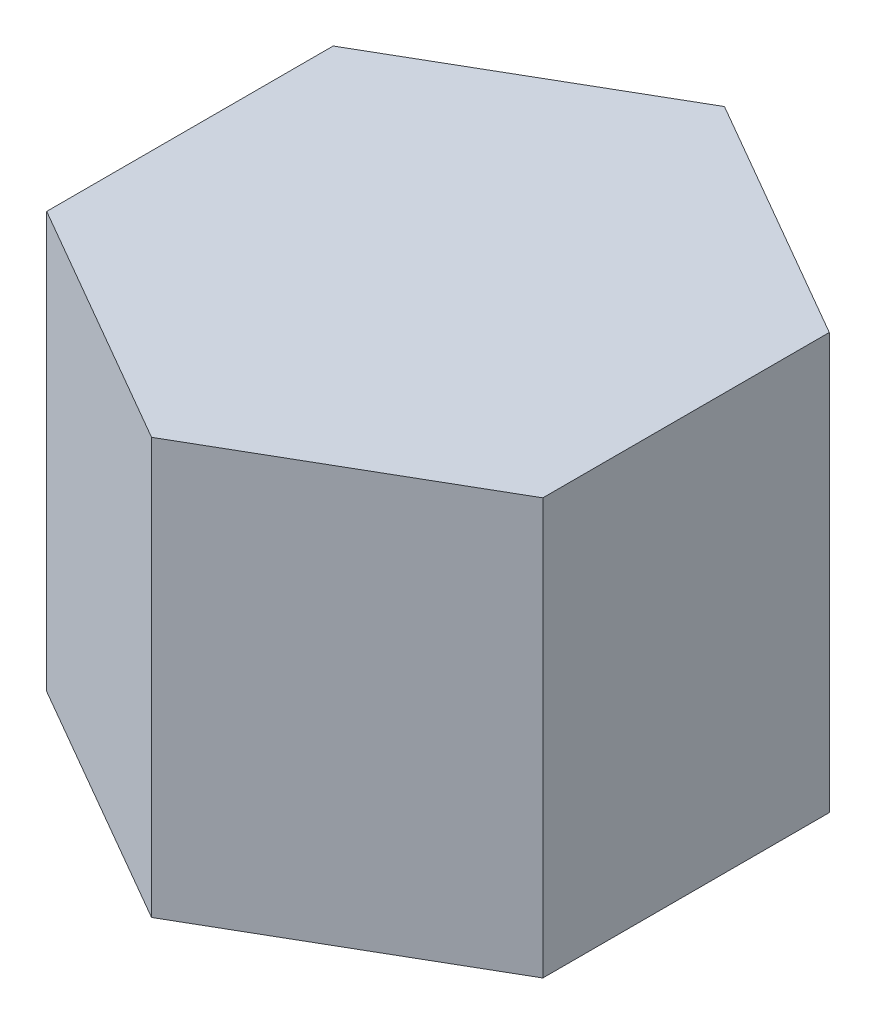
ISO-10303-21;
HEADER;
FILE_DESCRIPTION(('STEP AP214'),'2;1');
FILE_NAME('part.step','',(''),(''),'','','');
FILE_SCHEMA(('AUTOMOTIVE_DESIGN { 1 0 10303 214 1 1 1 1 }'));
ENDSEC;
DATA;
#1=APPLICATION_CONTEXT('core data for automotive mechanical design processes');
#2=APPLICATION_PROTOCOL_DEFINITION('international standard','automotive_design',2000,#1);
#3=PRODUCT_CONTEXT('',#1,'mechanical');
#4=PRODUCT('Part','Part','',(#3));
#5=PRODUCT_RELATED_PRODUCT_CATEGORY('part','',(#4));
#6=PRODUCT_DEFINITION_FORMATION('','',#4);
#7=PRODUCT_DEFINITION_CONTEXT('part definition',#1,'design');
#8=PRODUCT_DEFINITION('design','',#6,#7);
#9=PRODUCT_DEFINITION_SHAPE('','',#8);
#10=(LENGTH_UNIT() NAMED_UNIT(*) SI_UNIT(.MILLI.,.METRE.));
#11=(NAMED_UNIT(*) PLANE_ANGLE_UNIT() SI_UNIT($,.RADIAN.));
#12=(NAMED_UNIT(*) SI_UNIT($,.STERADIAN.) SOLID_ANGLE_UNIT());
#13=UNCERTAINTY_MEASURE_WITH_UNIT(LENGTH_MEASURE(1.E-05),#10,'distance_accuracy_value','');
#14=(GEOMETRIC_REPRESENTATION_CONTEXT(3) GLOBAL_UNCERTAINTY_ASSIGNED_CONTEXT((#13)) GLOBAL_UNIT_ASSIGNED_CONTEXT((#10,
#11,#12)) REPRESENTATION_CONTEXT('',''));
#15=CARTESIAN_POINT('',(0.,0.,0.));
#16=DIRECTION('',(0.,0.,1.));
#17=DIRECTION('',(1.,0.,0.));
#18=AXIS2_PLACEMENT_3D('',#15,#16,#17);
#19=CARTESIAN_POINT('',(207.642660308706,-148.537700895744,294.971072835632));
#20=DIRECTION('',(-0.499999999999909,0.,-0.866025403784491));
#21=DIRECTION('',(-0.866025403784491,0.,0.499999999999909));
#22=AXIS2_PLACEMENT_3D('',#19,#20,#21);
#23=PLANE('',#22);
#24=CARTESIAN_POINT('',(207.339551417381,-149.045793579175,295.146072835632));
#25=DIRECTION('',(0.866025403784491,0.,-0.499999999999909));
#26=VECTOR('',#25,1.);
#27=LINE('',#24,#26);
#28=CARTESIAN_POINT('',(207.339551417382,-149.045793579175,295.146072835632));
#29=VERTEX_POINT('',#28);
#30=CARTESIAN_POINT('',(207.642660308706,-149.045793579175,294.971072835632));
#31=VERTEX_POINT('',#30);
#32=EDGE_CURVE('E170',#29,#31,#27,.T.);
#33=ORIENTED_EDGE('',*,*,#32,.T.);
#34=CARTESIAN_POINT('',(207.642660308706,-148.537700895744,294.971072835632));
#35=DIRECTION('',(0.,-1.,0.));
#36=VECTOR('',#35,1.);
#37=LINE('',#34,#36);
#38=CARTESIAN_POINT('',(207.642660308706,-148.537700895744,294.971072835632));
#39=VERTEX_POINT('',#38);
#40=EDGE_CURVE('E35',#39,#31,#37,.T.);
#41=ORIENTED_EDGE('',*,*,#40,.F.);
#42=CARTESIAN_POINT('',(207.339551417381,-148.537700895744,295.146072835632));
#43=DIRECTION('',(0.866025403784491,0.,-0.499999999999909));
#44=VECTOR('',#43,1.);
#45=LINE('',#42,#44);
#46=CARTESIAN_POINT('',(207.339551417382,-148.537700895744,295.146072835632));
#47=VERTEX_POINT('',#46);
#48=EDGE_CURVE('E159',#47,#39,#45,.T.);
#49=ORIENTED_EDGE('',*,*,#48,.F.);
#50=CARTESIAN_POINT('',(207.339551417381,-148.537700895744,295.146072835632));
#51=DIRECTION('',(0.,-1.,0.));
#52=VECTOR('',#51,1.);
#53=LINE('',#50,#52);
#54=EDGE_CURVE('E10',#47,#29,#53,.T.);
#55=ORIENTED_EDGE('',*,*,#54,.T.);
#56=EDGE_LOOP('',(#33,#41,#49,#55));
#57=FACE_BOUND('',#56,.T.);
#58=ADVANCED_FACE('F16',(#57),#23,.F.);
#59=CARTESIAN_POINT('',(207.339551417382,-148.537700895744,295.146072835632));
#60=DIRECTION('',(0.500000000000062,0.,-0.866025403784403));
#61=DIRECTION('',(-0.866025403784403,0.,-0.500000000000062));
#62=AXIS2_PLACEMENT_3D('',#59,#60,#61);
#63=PLANE('',#62);
#64=CARTESIAN_POINT('',(207.036442526057,-149.045793579175,294.971072835632));
#65=DIRECTION('',(0.866025403784403,0.,0.500000000000062));
#66=VECTOR('',#65,1.);
#67=LINE('',#64,#66);
#68=CARTESIAN_POINT('',(207.036442526057,-149.045793579175,294.971072835632));
#69=VERTEX_POINT('',#68);
#70=EDGE_CURVE('E167',#69,#29,#67,.T.);
#71=ORIENTED_EDGE('',*,*,#70,.T.);
#72=ORIENTED_EDGE('',*,*,#54,.F.);
#73=CARTESIAN_POINT('',(207.036442526057,-148.537700895744,294.971072835632));
#74=DIRECTION('',(0.866025403784403,0.,0.500000000000062));
#75=VECTOR('',#74,1.);
#76=LINE('',#73,#75);
#77=CARTESIAN_POINT('',(207.036442526057,-148.537700895744,294.971072835632));
#78=VERTEX_POINT('',#77);
#79=EDGE_CURVE('E156',#78,#47,#76,.T.);
#80=ORIENTED_EDGE('',*,*,#79,.F.);
#81=CARTESIAN_POINT('',(207.036442526057,-148.537700895744,294.971072835632));
#82=DIRECTION('',(0.,-1.,0.));
#83=VECTOR('',#82,1.);
#84=LINE('',#81,#83);
#85=EDGE_CURVE('E27',#78,#69,#84,.T.);
#86=ORIENTED_EDGE('',*,*,#85,.T.);
#87=EDGE_LOOP('',(#71,#72,#80,#86));
#88=FACE_BOUND('',#87,.T.);
#89=ADVANCED_FACE('F189',(#88),#63,.F.);
#90=CARTESIAN_POINT('',(207.036442526057,-148.537700895744,290.831971220494));
#91=DIRECTION('',(1.,0.,0.));
#92=DIRECTION('',(0.,1.,0.));
#93=AXIS2_PLACEMENT_3D('',#90,#91,#92);
#94=PLANE('',#93);
#95=CARTESIAN_POINT('',(207.036442526057,-149.045793579175,294.621072835632));
#96=DIRECTION('',(0.,0.,1.));
#97=VECTOR('',#96,1.);
#98=LINE('',#95,#97);
#99=CARTESIAN_POINT('',(207.036442526057,-149.045793579175,294.621072835632));
#100=VERTEX_POINT('',#99);
#101=EDGE_CURVE('E163',#100,#69,#98,.T.);
#102=ORIENTED_EDGE('',*,*,#101,.T.);
#103=ORIENTED_EDGE('',*,*,#85,.F.);
#104=CARTESIAN_POINT('',(207.036442526057,-148.537700895744,294.621072835632));
#105=DIRECTION('',(0.,0.,1.));
#106=VECTOR('',#105,1.);
#107=LINE('',#104,#106);
#108=CARTESIAN_POINT('',(207.036442526057,-148.537700895744,294.621072835632));
#109=VERTEX_POINT('',#108);
#110=EDGE_CURVE('E106',#109,#78,#107,.T.);
#111=ORIENTED_EDGE('',*,*,#110,.F.);
#112=CARTESIAN_POINT('',(207.036442526057,-148.537700895744,294.621072835632));
#113=DIRECTION('',(0.,-1.,0.));
#114=VECTOR('',#113,1.);
#115=LINE('',#112,#114);
#116=EDGE_CURVE('E94',#109,#100,#115,.T.);
#117=ORIENTED_EDGE('',*,*,#116,.T.);
#118=EDGE_LOOP('',(#102,#103,#111,#117));
#119=FACE_BOUND('',#118,.T.);
#120=ADVANCED_FACE('F198',(#119),#94,.F.);
#121=CARTESIAN_POINT('',(207.036442526057,-148.537700895744,294.621072835632));
#122=DIRECTION('',(0.499999999999978,0.,0.866025403784452));
#123=DIRECTION('',(0.866025403784452,0.,-0.499999999999978));
#124=AXIS2_PLACEMENT_3D('',#121,#122,#123);
#125=PLANE('',#124);
#126=CARTESIAN_POINT('',(207.339551417382,-149.045793579175,294.446072835632));
#127=DIRECTION('',(-0.866025403784452,0.,0.499999999999978));
#128=VECTOR('',#127,1.);
#129=LINE('',#126,#128);
#130=CARTESIAN_POINT('',(207.339551417382,-149.045793579175,294.446072835632));
#131=VERTEX_POINT('',#130);
#132=EDGE_CURVE('E162',#131,#100,#129,.T.);
#133=ORIENTED_EDGE('',*,*,#132,.T.);
#134=ORIENTED_EDGE('',*,*,#116,.F.);
#135=CARTESIAN_POINT('',(207.339551417382,-148.537700895744,294.446072835632));
#136=DIRECTION('',(-0.866025403784452,0.,0.499999999999978));
#137=VECTOR('',#136,1.);
#138=LINE('',#135,#137);
#139=CARTESIAN_POINT('',(207.339551417382,-148.537700895744,294.446072835632));
#140=VERTEX_POINT('',#139);
#141=EDGE_CURVE('E98',#140,#109,#138,.T.);
#142=ORIENTED_EDGE('',*,*,#141,.F.);
#143=CARTESIAN_POINT('',(207.339551417382,-148.537700895744,294.446072835632));
#144=DIRECTION('',(0.,-1.,0.));
#145=VECTOR('',#144,1.);
#146=LINE('',#143,#145);
#147=EDGE_CURVE('E79',#140,#131,#146,.T.);
#148=ORIENTED_EDGE('',*,*,#147,.T.);
#149=EDGE_LOOP('',(#133,#134,#142,#148));
#150=FACE_BOUND('',#149,.T.);
#151=ADVANCED_FACE('F100',(#150),#125,.F.);
#152=CARTESIAN_POINT('',(207.339551417382,-148.537700895744,294.446072835632));
#153=DIRECTION('',(-0.500000000000012,0.,0.866025403784432));
#154=DIRECTION('',(0.866025403784432,0.,0.500000000000012));
#155=AXIS2_PLACEMENT_3D('',#152,#153,#154);
#156=PLANE('',#155);
#157=CARTESIAN_POINT('',(207.642660308706,-149.045793579175,294.621072835632));
#158=DIRECTION('',(-0.866025403784432,0.,-0.500000000000012));
#159=VECTOR('',#158,1.);
#160=LINE('',#157,#159);
#161=CARTESIAN_POINT('',(207.642660308706,-149.045793579175,294.621072835632));
#162=VERTEX_POINT('',#161);
#163=EDGE_CURVE('E88',#162,#131,#160,.T.);
#164=ORIENTED_EDGE('',*,*,#163,.T.);
#165=ORIENTED_EDGE('',*,*,#147,.F.);
#166=CARTESIAN_POINT('',(207.642660308706,-148.537700895744,294.621072835632));
#167=DIRECTION('',(-0.866025403784432,0.,-0.500000000000012));
#168=VECTOR('',#167,1.);
#169=LINE('',#166,#168);
#170=CARTESIAN_POINT('',(207.642660308706,-148.537700895744,294.621072835632));
#171=VERTEX_POINT('',#170);
#172=EDGE_CURVE('E84',#171,#140,#169,.T.);
#173=ORIENTED_EDGE('',*,*,#172,.F.);
#174=CARTESIAN_POINT('',(207.642660308706,-148.537700895744,294.621072835632));
#175=DIRECTION('',(0.,-1.,0.));
#176=VECTOR('',#175,1.);
#177=LINE('',#174,#176);
#178=EDGE_CURVE('E58',#171,#162,#177,.T.);
#179=ORIENTED_EDGE('',*,*,#178,.T.);
#180=EDGE_LOOP('',(#164,#165,#173,#179));
#181=FACE_BOUND('',#180,.T.);
#182=ADVANCED_FACE('F82',(#181),#156,.F.);
#183=CARTESIAN_POINT('',(207.642660308706,-148.537700895744,290.831971220494));
#184=DIRECTION('',(-1.,0.,0.));
#185=DIRECTION('',(0.,-1.,0.));
#186=AXIS2_PLACEMENT_3D('',#183,#184,#185);
#187=PLANE('',#186);
#188=CARTESIAN_POINT('',(207.642660308706,-149.045793579175,294.971072835632));
#189=DIRECTION('',(0.,0.,-1.));
#190=VECTOR('',#189,1.);
#191=LINE('',#188,#190);
#192=EDGE_CURVE('E160',#31,#162,#191,.T.);
#193=ORIENTED_EDGE('',*,*,#192,.T.);
#194=ORIENTED_EDGE('',*,*,#178,.F.);
#195=CARTESIAN_POINT('',(207.642660308706,-148.537700895744,294.971072835632));
#196=DIRECTION('',(0.,0.,-1.));
#197=VECTOR('',#196,1.);
#198=LINE('',#195,#197);
#199=EDGE_CURVE('E112',#39,#171,#198,.T.);
#200=ORIENTED_EDGE('',*,*,#199,.F.);
#201=ORIENTED_EDGE('',*,*,#40,.T.);
#202=EDGE_LOOP('',(#193,#194,#200,#201));
#203=FACE_BOUND('',#202,.T.);
#204=ADVANCED_FACE('F131',(#203),#187,.F.);
#205=CARTESIAN_POINT('',(206.339551417382,-148.537700895744,290.831971220494));
#206=DIRECTION('',(0.,-1.,0.));
#207=DIRECTION('',(1.,0.,0.));
#208=AXIS2_PLACEMENT_3D('',#205,#206,#207);
#209=PLANE('',#208);
#210=ORIENTED_EDGE('',*,*,#48,.T.);
#211=ORIENTED_EDGE('',*,*,#199,.T.);
#212=ORIENTED_EDGE('',*,*,#172,.T.);
#213=ORIENTED_EDGE('',*,*,#141,.T.);
#214=ORIENTED_EDGE('',*,*,#110,.T.);
#215=ORIENTED_EDGE('',*,*,#79,.T.);
#216=EDGE_LOOP('',(#210,#211,#212,#213,#214,#215));
#217=FACE_BOUND('',#216,.T.);
#218=ADVANCED_FACE('F111',(#217),#209,.F.);
#219=CARTESIAN_POINT('',(206.339551417382,-149.045793579175,290.831971220494));
#220=DIRECTION('',(0.,-1.,0.));
#221=DIRECTION('',(1.,0.,0.));
#222=AXIS2_PLACEMENT_3D('',#219,#220,#221);
#223=PLANE('',#222);
#224=ORIENTED_EDGE('',*,*,#32,.F.);
#225=ORIENTED_EDGE('',*,*,#70,.F.);
#226=ORIENTED_EDGE('',*,*,#101,.F.);
#227=ORIENTED_EDGE('',*,*,#132,.F.);
#228=ORIENTED_EDGE('',*,*,#163,.F.);
#229=ORIENTED_EDGE('',*,*,#192,.F.);
#230=EDGE_LOOP('',(#224,#225,#226,#227,#228,#229));
#231=FACE_BOUND('',#230,.T.);
#232=ADVANCED_FACE('F130',(#231),#223,.T.);
#233=CLOSED_SHELL('',(#58,#89,#120,#151,#182,#204,#218,#232));
#234=MANIFOLD_SOLID_BREP('B1',#233);
#235=ADVANCED_BREP_SHAPE_REPRESENTATION('',(#18,#234),#14);
#236=SHAPE_DEFINITION_REPRESENTATION(#9,#235);
ENDSEC;
END-ISO-10303-21;
